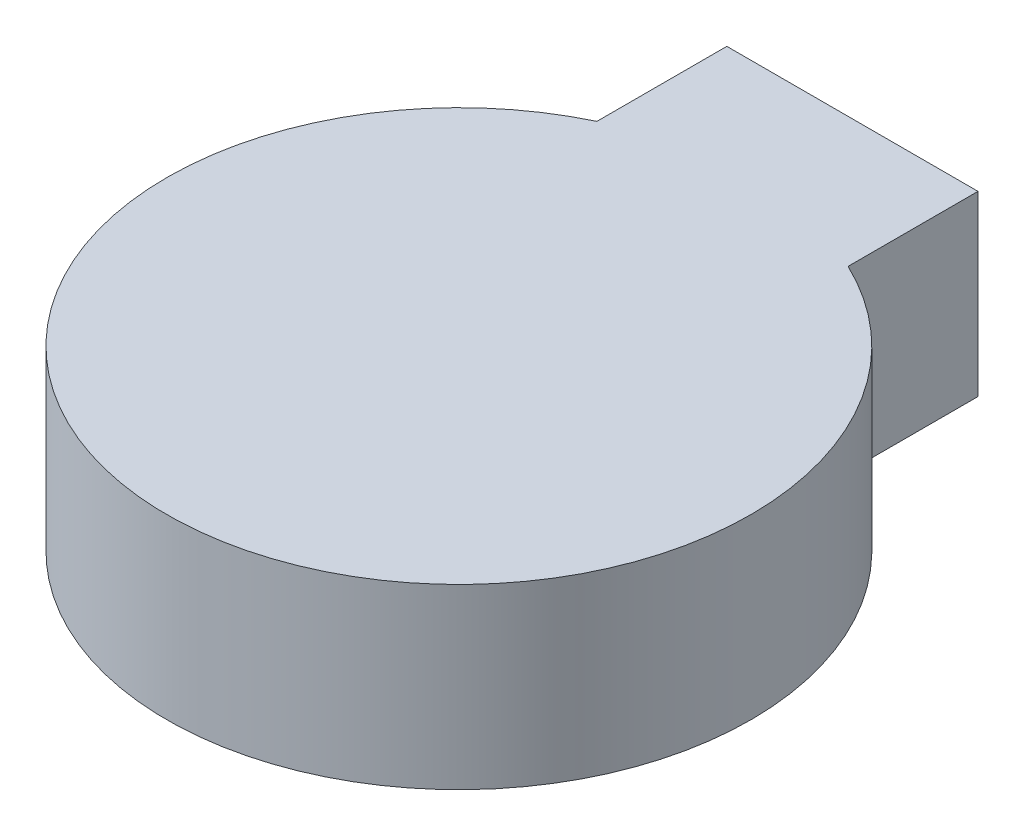
ISO-10303-21;
HEADER;
FILE_DESCRIPTION(('STEP AP214'),'2;1');
FILE_NAME('part.step','',(''),(''),'','','');
FILE_SCHEMA(('AUTOMOTIVE_DESIGN { 1 0 10303 214 1 1 1 1 }'));
ENDSEC;
DATA;
#1=APPLICATION_CONTEXT('core data for automotive mechanical design processes');
#2=APPLICATION_PROTOCOL_DEFINITION('international standard','automotive_design',2000,#1);
#3=PRODUCT_CONTEXT('',#1,'mechanical');
#4=PRODUCT('Part','Part','',(#3));
#5=PRODUCT_RELATED_PRODUCT_CATEGORY('part','',(#4));
#6=PRODUCT_DEFINITION_FORMATION('','',#4);
#7=PRODUCT_DEFINITION_CONTEXT('part definition',#1,'design');
#8=PRODUCT_DEFINITION('design','',#6,#7);
#9=PRODUCT_DEFINITION_SHAPE('','',#8);
#10=(LENGTH_UNIT() NAMED_UNIT(*) SI_UNIT(.MILLI.,.METRE.));
#11=(NAMED_UNIT(*) PLANE_ANGLE_UNIT() SI_UNIT($,.RADIAN.));
#12=(NAMED_UNIT(*) SI_UNIT($,.STERADIAN.) SOLID_ANGLE_UNIT());
#13=UNCERTAINTY_MEASURE_WITH_UNIT(LENGTH_MEASURE(1.E-05),#10,'distance_accuracy_value','');
#14=(GEOMETRIC_REPRESENTATION_CONTEXT(3) GLOBAL_UNCERTAINTY_ASSIGNED_CONTEXT((#13)) GLOBAL_UNIT_ASSIGNED_CONTEXT((#10,
#11,#12)) REPRESENTATION_CONTEXT('',''));
#15=CARTESIAN_POINT('',(0.,0.,0.));
#16=DIRECTION('',(0.,0.,1.));
#17=DIRECTION('',(1.,0.,0.));
#18=AXIS2_PLACEMENT_3D('',#15,#16,#17);
#19=CARTESIAN_POINT('',(4.94589092425586,7.,-15.5));
#20=DIRECTION('',(-1.,0.,0.));
#21=DIRECTION('',(0.,0.,1.));
#22=AXIS2_PLACEMENT_3D('',#19,#20,#21);
#23=PLANE('',#22);
#24=DIRECTION('',(0.,0.,-1.));
#25=VECTOR('',#24,1.);
#26=CARTESIAN_POINT('',(4.94589092425586,0.,-15.5));
#27=LINE('',#26,#25);
#28=CARTESIAN_POINT('',(4.94589092425587,0.,-10.382107828633));
#29=VERTEX_POINT('',#28);
#30=CARTESIAN_POINT('',(4.94589092425586,0.,-15.5));
#31=VERTEX_POINT('',#30);
#32=EDGE_CURVE('E96',#29,#31,#27,.T.);
#33=ORIENTED_EDGE('',*,*,#32,.T.);
#34=DIRECTION('',(0.,-1.,0.));
#35=VECTOR('',#34,1.);
#36=CARTESIAN_POINT('',(4.94589092425586,7.,-15.5));
#37=LINE('',#36,#35);
#38=CARTESIAN_POINT('',(4.94589092425586,7.,-15.5));
#39=VERTEX_POINT('',#38);
#40=EDGE_CURVE('E11',#39,#31,#37,.T.);
#41=ORIENTED_EDGE('',*,*,#40,.F.);
#42=DIRECTION('',(0.,0.,-1.));
#43=VECTOR('',#42,1.);
#44=CARTESIAN_POINT('',(4.94589092425586,7.,-15.5));
#45=LINE('',#44,#43);
#46=CARTESIAN_POINT('',(4.94589092425587,7.,-10.382107828633));
#47=VERTEX_POINT('',#46);
#48=EDGE_CURVE('E84',#47,#39,#45,.T.);
#49=ORIENTED_EDGE('',*,*,#48,.F.);
#50=DIRECTION('',(0.,-1.,0.));
#51=VECTOR('',#50,1.);
#52=CARTESIAN_POINT('',(4.94589092425587,7.,-10.382107828633));
#53=LINE('',#52,#51);
#54=EDGE_CURVE('E92',#47,#29,#53,.T.);
#55=ORIENTED_EDGE('',*,*,#54,.T.);
#56=EDGE_LOOP('',(#33,#41,#49,#55));
#57=FACE_BOUND('',#56,.T.);
#58=ADVANCED_FACE('F33',(#57),#23,.F.);
#59=CARTESIAN_POINT('',(-4.94589092425586,7.,-15.5));
#60=DIRECTION('',(0.,0.,1.));
#61=DIRECTION('',(1.,0.,0.));
#62=AXIS2_PLACEMENT_3D('',#59,#60,#61);
#63=PLANE('',#62);
#64=DIRECTION('',(-1.,0.,0.));
#65=VECTOR('',#64,1.);
#66=CARTESIAN_POINT('',(-4.94589092425586,0.,-15.5));
#67=LINE('',#66,#65);
#68=CARTESIAN_POINT('',(-4.94589092425586,0.,-15.5));
#69=VERTEX_POINT('',#68);
#70=EDGE_CURVE('E88',#31,#69,#67,.T.);
#71=ORIENTED_EDGE('',*,*,#70,.T.);
#72=DIRECTION('',(0.,-1.,0.));
#73=VECTOR('',#72,1.);
#74=CARTESIAN_POINT('',(-4.94589092425586,7.,-15.5));
#75=LINE('',#74,#73);
#76=CARTESIAN_POINT('',(-4.94589092425586,7.,-15.5));
#77=VERTEX_POINT('',#76);
#78=EDGE_CURVE('E41',#77,#69,#75,.T.);
#79=ORIENTED_EDGE('',*,*,#78,.F.);
#80=DIRECTION('',(-1.,0.,0.));
#81=VECTOR('',#80,1.);
#82=CARTESIAN_POINT('',(-4.94589092425586,7.,-15.5));
#83=LINE('',#82,#81);
#84=EDGE_CURVE('E79',#39,#77,#83,.T.);
#85=ORIENTED_EDGE('',*,*,#84,.F.);
#86=ORIENTED_EDGE('',*,*,#40,.T.);
#87=EDGE_LOOP('',(#71,#79,#85,#86));
#88=FACE_BOUND('',#87,.T.);
#89=ADVANCED_FACE('F87',(#88),#63,.F.);
#90=CARTESIAN_POINT('',(-4.94589092425586,7.,-10.382107828633));
#91=DIRECTION('',(1.,0.,0.));
#92=DIRECTION('',(0.,0.,-1.));
#93=AXIS2_PLACEMENT_3D('',#90,#91,#92);
#94=PLANE('',#93);
#95=DIRECTION('',(0.,0.,1.));
#96=VECTOR('',#95,1.);
#97=CARTESIAN_POINT('',(-4.94589092425586,0.,-10.382107828633));
#98=LINE('',#97,#96);
#99=CARTESIAN_POINT('',(-4.94589092425586,0.,-10.382107828633));
#100=VERTEX_POINT('',#99);
#101=EDGE_CURVE('E66',#69,#100,#98,.T.);
#102=ORIENTED_EDGE('',*,*,#101,.T.);
#103=DIRECTION('',(0.,-1.,0.));
#104=VECTOR('',#103,1.);
#105=CARTESIAN_POINT('',(-4.94589092425586,7.,-10.382107828633));
#106=LINE('',#105,#104);
#107=CARTESIAN_POINT('',(-4.94589092425586,7.,-10.382107828633));
#108=VERTEX_POINT('',#107);
#109=EDGE_CURVE('E89',#108,#100,#106,.T.);
#110=ORIENTED_EDGE('',*,*,#109,.F.);
#111=DIRECTION('',(0.,0.,1.));
#112=VECTOR('',#111,1.);
#113=CARTESIAN_POINT('',(-4.94589092425586,7.,-10.382107828633));
#114=LINE('',#113,#112);
#115=EDGE_CURVE('E82',#77,#108,#114,.T.);
#116=ORIENTED_EDGE('',*,*,#115,.F.);
#117=ORIENTED_EDGE('',*,*,#78,.T.);
#118=EDGE_LOOP('',(#102,#110,#116,#117));
#119=FACE_BOUND('',#118,.T.);
#120=ADVANCED_FACE('F90',(#119),#94,.F.);
#121=CARTESIAN_POINT('',(0.,7.,0.));
#122=DIRECTION('',(0.,-1.,0.));
#123=DIRECTION('',(0.,0.,-1.));
#124=AXIS2_PLACEMENT_3D('',#121,#122,#123);
#125=CYLINDRICAL_SURFACE('',#124,11.5);
#126=CARTESIAN_POINT('',(0.,0.,0.));
#127=DIRECTION('',(0.,1.,0.));
#128=DIRECTION('',(0.,0.,1.));
#129=AXIS2_PLACEMENT_3D('',#126,#127,#128);
#130=CIRCLE('',#129,11.5);
#131=EDGE_CURVE('E72',#100,#29,#130,.T.);
#132=ORIENTED_EDGE('',*,*,#131,.T.);
#133=ORIENTED_EDGE('',*,*,#54,.F.);
#134=CARTESIAN_POINT('',(0.,7.,0.));
#135=DIRECTION('',(0.,1.,0.));
#136=DIRECTION('',(0.,0.,1.));
#137=AXIS2_PLACEMENT_3D('',#134,#135,#136);
#138=CIRCLE('',#137,11.5);
#139=EDGE_CURVE('E49',#108,#47,#138,.T.);
#140=ORIENTED_EDGE('',*,*,#139,.F.);
#141=ORIENTED_EDGE('',*,*,#109,.T.);
#142=EDGE_LOOP('',(#132,#133,#140,#141));
#143=FACE_BOUND('',#142,.T.);
#144=ADVANCED_FACE('F103',(#143),#125,.T.);
#145=CARTESIAN_POINT('',(0.,7.,0.));
#146=DIRECTION('',(0.,1.,0.));
#147=DIRECTION('',(0.,0.,1.));
#148=AXIS2_PLACEMENT_3D('',#145,#146,#147);
#149=PLANE('',#148);
#150=ORIENTED_EDGE('',*,*,#48,.T.);
#151=ORIENTED_EDGE('',*,*,#84,.T.);
#152=ORIENTED_EDGE('',*,*,#115,.T.);
#153=ORIENTED_EDGE('',*,*,#139,.T.);
#154=EDGE_LOOP('',(#150,#151,#152,#153));
#155=FACE_BOUND('',#154,.T.);
#156=ADVANCED_FACE('F80',(#155),#149,.T.);
#157=CARTESIAN_POINT('',(0.,0.,0.));
#158=DIRECTION('',(0.,1.,0.));
#159=DIRECTION('',(0.,0.,1.));
#160=AXIS2_PLACEMENT_3D('',#157,#158,#159);
#161=PLANE('',#160);
#162=ORIENTED_EDGE('',*,*,#32,.F.);
#163=ORIENTED_EDGE('',*,*,#131,.F.);
#164=ORIENTED_EDGE('',*,*,#101,.F.);
#165=ORIENTED_EDGE('',*,*,#70,.F.);
#166=EDGE_LOOP('',(#162,#163,#164,#165));
#167=FACE_BOUND('',#166,.T.);
#168=ADVANCED_FACE('F106',(#167),#161,.F.);
#169=CLOSED_SHELL('',(#58,#89,#120,#144,#156,#168));
#170=MANIFOLD_SOLID_BREP('B2',#169);
#171=ADVANCED_BREP_SHAPE_REPRESENTATION('',(#18,#170),#14);
#172=SHAPE_DEFINITION_REPRESENTATION(#9,#171);
ENDSEC;
END-ISO-10303-21;
